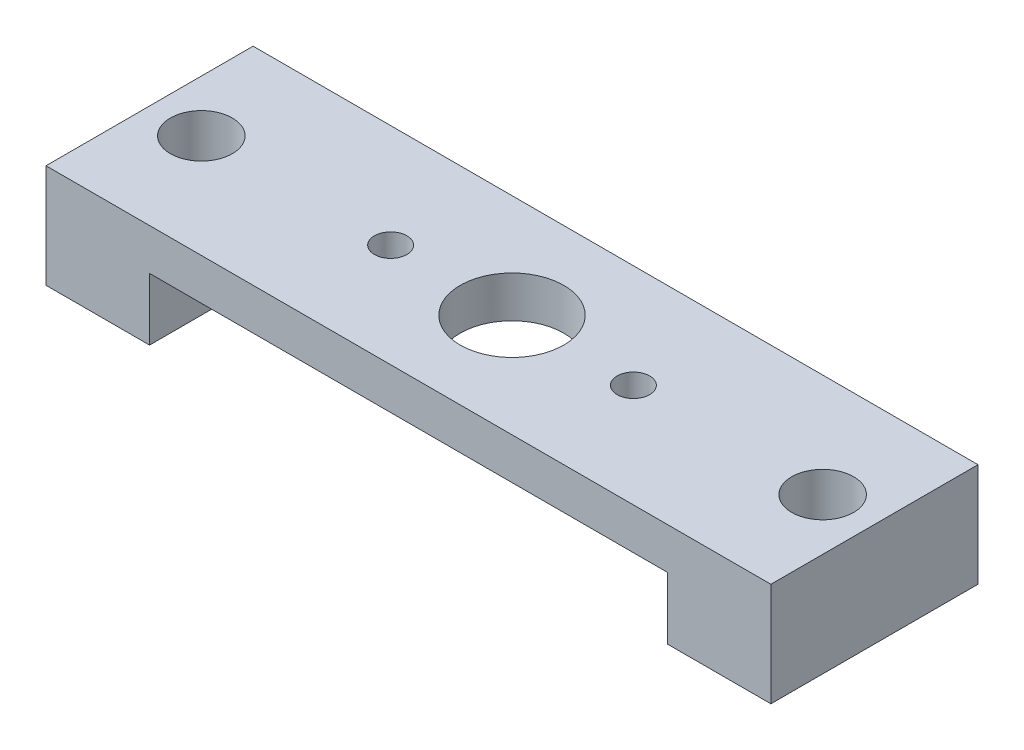
ISO-10303-21;
HEADER;
FILE_DESCRIPTION(('STEP AP214'),'2;1');
FILE_NAME('part.step','',(''),(''),'','','');
FILE_SCHEMA(('AUTOMOTIVE_DESIGN { 1 0 10303 214 1 1 1 1 }'));
ENDSEC;
DATA;
#1=APPLICATION_CONTEXT('core data for automotive mechanical design processes');
#2=APPLICATION_PROTOCOL_DEFINITION('international standard','automotive_design',2000,#1);
#3=PRODUCT_CONTEXT('',#1,'mechanical');
#4=PRODUCT('Part','Part','',(#3));
#5=PRODUCT_RELATED_PRODUCT_CATEGORY('part','',(#4));
#6=PRODUCT_DEFINITION_FORMATION('','',#4);
#7=PRODUCT_DEFINITION_CONTEXT('part definition',#1,'design');
#8=PRODUCT_DEFINITION('design','',#6,#7);
#9=PRODUCT_DEFINITION_SHAPE('','',#8);
#10=(LENGTH_UNIT() NAMED_UNIT(*) SI_UNIT(.MILLI.,.METRE.));
#11=(NAMED_UNIT(*) PLANE_ANGLE_UNIT() SI_UNIT($,.RADIAN.));
#12=(NAMED_UNIT(*) SI_UNIT($,.STERADIAN.) SOLID_ANGLE_UNIT());
#13=UNCERTAINTY_MEASURE_WITH_UNIT(LENGTH_MEASURE(1.E-05),#10,'distance_accuracy_value','');
#14=(GEOMETRIC_REPRESENTATION_CONTEXT(3) GLOBAL_UNCERTAINTY_ASSIGNED_CONTEXT((#13)) GLOBAL_UNIT_ASSIGNED_CONTEXT((#10,
#11,#12)) REPRESENTATION_CONTEXT('',''));
#15=CARTESIAN_POINT('',(0.,0.,0.));
#16=DIRECTION('',(0.,0.,1.));
#17=DIRECTION('',(1.,0.,0.));
#18=AXIS2_PLACEMENT_3D('',#15,#16,#17);
#19=CARTESIAN_POINT('',(0.,0.,0.));
#20=DIRECTION('',(0.,-1.,0.));
#21=DIRECTION('',(0.,0.,-1.));
#22=AXIS2_PLACEMENT_3D('',#19,#20,#21);
#23=PLANE('',#22);
#24=CARTESIAN_POINT('',(22.225,0.,-6.35));
#25=DIRECTION('',(0.,-1.,0.));
#26=DIRECTION('',(0.,0.,-1.));
#27=AXIS2_PLACEMENT_3D('',#24,#25,#26);
#28=CIRCLE('',#27,3.175);
#29=CARTESIAN_POINT('',(22.225,0.,-9.525));
#30=VERTEX_POINT('',#29);
#31=EDGE_CURVE('E341',#30,#30,#28,.T.);
#32=ORIENTED_EDGE('',*,*,#31,.F.);
#33=EDGE_LOOP('',(#32));
#34=FACE_BOUND('',#33,.T.);
#35=CARTESIAN_POINT('',(14.7828,0.,-6.35));
#36=DIRECTION('',(0.,-1.,0.));
#37=DIRECTION('',(0.,0.,-1.));
#38=AXIS2_PLACEMENT_3D('',#35,#36,#37);
#39=CIRCLE('',#38,0.99695);
#40=CARTESIAN_POINT('',(14.7828,0.,-7.34695));
#41=VERTEX_POINT('',#40);
#42=EDGE_CURVE('E351',#41,#41,#39,.T.);
#43=ORIENTED_EDGE('',*,*,#42,.F.);
#44=EDGE_LOOP('',(#43));
#45=FACE_BOUND('',#44,.T.);
#46=CARTESIAN_POINT('',(29.6672,0.,-6.35));
#47=DIRECTION('',(0.,-1.,0.));
#48=DIRECTION('',(0.,0.,-1.));
#49=AXIS2_PLACEMENT_3D('',#46,#47,#48);
#50=CIRCLE('',#49,0.99695);
#51=CARTESIAN_POINT('',(29.6672,0.,-7.34695));
#52=VERTEX_POINT('',#51);
#53=EDGE_CURVE('E357',#52,#52,#50,.T.);
#54=ORIENTED_EDGE('',*,*,#53,.F.);
#55=EDGE_LOOP('',(#54));
#56=FACE_BOUND('',#55,.T.);
#57=DIRECTION('',(-1.,0.,0.));
#58=VECTOR('',#57,1.);
#59=CARTESIAN_POINT('',(0.,0.,-12.7));
#60=LINE('',#59,#58);
#61=CARTESIAN_POINT('',(38.1,0.,-12.7));
#62=VERTEX_POINT('',#61);
#63=CARTESIAN_POINT('',(6.35,0.,-12.7));
#64=VERTEX_POINT('',#63);
#65=EDGE_CURVE('E55',#62,#64,#60,.T.);
#66=ORIENTED_EDGE('',*,*,#65,.F.);
#67=DIRECTION('',(0.,0.,-1.));
#68=VECTOR('',#67,1.);
#69=CARTESIAN_POINT('',(38.1,0.,0.));
#70=LINE('',#69,#68);
#71=CARTESIAN_POINT('',(38.1,0.,0.));
#72=VERTEX_POINT('',#71);
#73=EDGE_CURVE('E121',#72,#62,#70,.T.);
#74=ORIENTED_EDGE('',*,*,#73,.F.);
#75=DIRECTION('',(1.,0.,0.));
#76=VECTOR('',#75,1.);
#77=CARTESIAN_POINT('',(0.,0.,0.));
#78=LINE('',#77,#76);
#79=CARTESIAN_POINT('',(6.35,0.,0.));
#80=VERTEX_POINT('',#79);
#81=EDGE_CURVE('E151',#80,#72,#78,.T.);
#82=ORIENTED_EDGE('',*,*,#81,.F.);
#83=DIRECTION('',(0.,0.,1.));
#84=VECTOR('',#83,1.);
#85=CARTESIAN_POINT('',(6.35,0.,0.));
#86=LINE('',#85,#84);
#87=EDGE_CURVE('E132',#64,#80,#86,.T.);
#88=ORIENTED_EDGE('',*,*,#87,.F.);
#89=EDGE_LOOP('',(#66,#74,#82,#88));
#90=FACE_BOUND('',#89,.T.);
#91=ADVANCED_FACE('F35',(#34,#45,#56,#90),#23,.T.);
#92=CARTESIAN_POINT('',(0.,2.54,0.));
#93=DIRECTION('',(1.,0.,0.));
#94=DIRECTION('',(0.,0.,-1.));
#95=AXIS2_PLACEMENT_3D('',#92,#93,#94);
#96=PLANE('',#95);
#97=DIRECTION('',(0.,-1.,0.));
#98=VECTOR('',#97,1.);
#99=CARTESIAN_POINT('',(0.,2.54,-12.7));
#100=LINE('',#99,#98);
#101=CARTESIAN_POINT('',(0.,2.54,-12.7));
#102=VERTEX_POINT('',#101);
#103=CARTESIAN_POINT('',(0.,-3.81,-12.7));
#104=VERTEX_POINT('',#103);
#105=EDGE_CURVE('E160',#102,#104,#100,.T.);
#106=ORIENTED_EDGE('',*,*,#105,.T.);
#107=DIRECTION('',(0.,0.,-1.));
#108=VECTOR('',#107,1.);
#109=CARTESIAN_POINT('',(0.,-3.81,0.));
#110=LINE('',#109,#108);
#111=CARTESIAN_POINT('',(0.,-3.81,0.));
#112=VERTEX_POINT('',#111);
#113=EDGE_CURVE('E133',#112,#104,#110,.T.);
#114=ORIENTED_EDGE('',*,*,#113,.F.);
#115=DIRECTION('',(0.,-1.,0.));
#116=VECTOR('',#115,1.);
#117=CARTESIAN_POINT('',(0.,2.54,0.));
#118=LINE('',#117,#116);
#119=CARTESIAN_POINT('',(0.,2.54,0.));
#120=VERTEX_POINT('',#119);
#121=EDGE_CURVE('E11',#120,#112,#118,.T.);
#122=ORIENTED_EDGE('',*,*,#121,.F.);
#123=DIRECTION('',(0.,0.,1.));
#124=VECTOR('',#123,1.);
#125=CARTESIAN_POINT('',(0.,2.54,0.));
#126=LINE('',#125,#124);
#127=EDGE_CURVE('E152',#102,#120,#126,.T.);
#128=ORIENTED_EDGE('',*,*,#127,.F.);
#129=EDGE_LOOP('',(#106,#114,#122,#128));
#130=FACE_BOUND('',#129,.T.);
#131=ADVANCED_FACE('F37',(#130),#96,.F.);
#132=CARTESIAN_POINT('',(0.,2.54,0.));
#133=DIRECTION('',(0.,0.,-1.));
#134=DIRECTION('',(-1.,0.,0.));
#135=AXIS2_PLACEMENT_3D('',#132,#133,#134);
#136=PLANE('',#135);
#137=ORIENTED_EDGE('',*,*,#121,.T.);
#138=DIRECTION('',(-1.,0.,0.));
#139=VECTOR('',#138,1.);
#140=CARTESIAN_POINT('',(0.,-3.81,0.));
#141=LINE('',#140,#139);
#142=CARTESIAN_POINT('',(6.35,-3.81,0.));
#143=VERTEX_POINT('',#142);
#144=EDGE_CURVE('E140',#143,#112,#141,.T.);
#145=ORIENTED_EDGE('',*,*,#144,.F.);
#146=DIRECTION('',(0.,1.,0.));
#147=VECTOR('',#146,1.);
#148=CARTESIAN_POINT('',(6.35,-3.81,0.));
#149=LINE('',#148,#147);
#150=EDGE_CURVE('E143',#143,#80,#149,.T.);
#151=ORIENTED_EDGE('',*,*,#150,.T.);
#152=ORIENTED_EDGE('',*,*,#81,.T.);
#153=DIRECTION('',(0.,1.,0.));
#154=VECTOR('',#153,1.);
#155=CARTESIAN_POINT('',(38.1,-3.81,0.));
#156=LINE('',#155,#154);
#157=CARTESIAN_POINT('',(38.1,-3.81,0.));
#158=VERTEX_POINT('',#157);
#159=EDGE_CURVE('E113',#158,#72,#156,.T.);
#160=ORIENTED_EDGE('',*,*,#159,.F.);
#161=DIRECTION('',(-1.,0.,0.));
#162=VECTOR('',#161,1.);
#163=CARTESIAN_POINT('',(44.45,-3.81,0.));
#164=LINE('',#163,#162);
#165=CARTESIAN_POINT('',(44.45,-3.81,0.));
#166=VERTEX_POINT('',#165);
#167=EDGE_CURVE('E110',#166,#158,#164,.T.);
#168=ORIENTED_EDGE('',*,*,#167,.F.);
#169=DIRECTION('',(0.,-1.,0.));
#170=VECTOR('',#169,1.);
#171=CARTESIAN_POINT('',(44.45,2.54,0.));
#172=LINE('',#171,#170);
#173=CARTESIAN_POINT('',(44.45,2.54,0.));
#174=VERTEX_POINT('',#173);
#175=EDGE_CURVE('E43',#174,#166,#172,.T.);
#176=ORIENTED_EDGE('',*,*,#175,.F.);
#177=DIRECTION('',(1.,0.,0.));
#178=VECTOR('',#177,1.);
#179=CARTESIAN_POINT('',(0.,2.54,0.));
#180=LINE('',#179,#178);
#181=EDGE_CURVE('E155',#120,#174,#180,.T.);
#182=ORIENTED_EDGE('',*,*,#181,.F.);
#183=EDGE_LOOP('',(#137,#145,#151,#152,#160,#168,#176,#182));
#184=FACE_BOUND('',#183,.T.);
#185=ADVANCED_FACE('F111',(#184),#136,.F.);
#186=CARTESIAN_POINT('',(44.45,2.54,0.));
#187=DIRECTION('',(-1.,0.,0.));
#188=DIRECTION('',(0.,0.,1.));
#189=AXIS2_PLACEMENT_3D('',#186,#187,#188);
#190=PLANE('',#189);
#191=ORIENTED_EDGE('',*,*,#175,.T.);
#192=DIRECTION('',(0.,0.,1.));
#193=VECTOR('',#192,1.);
#194=CARTESIAN_POINT('',(44.45,-3.81,0.));
#195=LINE('',#194,#193);
#196=CARTESIAN_POINT('',(44.45,-3.81,-12.7));
#197=VERTEX_POINT('',#196);
#198=EDGE_CURVE('E105',#197,#166,#195,.T.);
#199=ORIENTED_EDGE('',*,*,#198,.F.);
#200=DIRECTION('',(0.,-1.,0.));
#201=VECTOR('',#200,1.);
#202=CARTESIAN_POINT('',(44.45,2.54,-12.7));
#203=LINE('',#202,#201);
#204=CARTESIAN_POINT('',(44.45,2.54,-12.7));
#205=VERTEX_POINT('',#204);
#206=EDGE_CURVE('E108',#205,#197,#203,.T.);
#207=ORIENTED_EDGE('',*,*,#206,.F.);
#208=DIRECTION('',(0.,0.,-1.));
#209=VECTOR('',#208,1.);
#210=CARTESIAN_POINT('',(44.45,2.54,0.));
#211=LINE('',#210,#209);
#212=EDGE_CURVE('E106',#174,#205,#211,.T.);
#213=ORIENTED_EDGE('',*,*,#212,.F.);
#214=EDGE_LOOP('',(#191,#199,#207,#213));
#215=FACE_BOUND('',#214,.T.);
#216=ADVANCED_FACE('F102',(#215),#190,.F.);
#217=CARTESIAN_POINT('',(0.,2.54,-12.7));
#218=DIRECTION('',(0.,0.,1.));
#219=DIRECTION('',(1.,0.,0.));
#220=AXIS2_PLACEMENT_3D('',#217,#218,#219);
#221=PLANE('',#220);
#222=ORIENTED_EDGE('',*,*,#206,.T.);
#223=DIRECTION('',(1.,0.,0.));
#224=VECTOR('',#223,1.);
#225=CARTESIAN_POINT('',(44.45,-3.81,-12.7));
#226=LINE('',#225,#224);
#227=CARTESIAN_POINT('',(38.1,-3.81,-12.7));
#228=VERTEX_POINT('',#227);
#229=EDGE_CURVE('E120',#228,#197,#226,.T.);
#230=ORIENTED_EDGE('',*,*,#229,.F.);
#231=DIRECTION('',(0.,1.,0.));
#232=VECTOR('',#231,1.);
#233=CARTESIAN_POINT('',(38.1,-3.81,-12.7));
#234=LINE('',#233,#232);
#235=EDGE_CURVE('E50',#228,#62,#234,.T.);
#236=ORIENTED_EDGE('',*,*,#235,.T.);
#237=ORIENTED_EDGE('',*,*,#65,.T.);
#238=DIRECTION('',(0.,1.,0.));
#239=VECTOR('',#238,1.);
#240=CARTESIAN_POINT('',(6.35,-3.81,-12.7));
#241=LINE('',#240,#239);
#242=CARTESIAN_POINT('',(6.35,-3.81,-12.7));
#243=VERTEX_POINT('',#242);
#244=EDGE_CURVE('E148',#243,#64,#241,.T.);
#245=ORIENTED_EDGE('',*,*,#244,.F.);
#246=DIRECTION('',(1.,0.,0.));
#247=VECTOR('',#246,1.);
#248=CARTESIAN_POINT('',(0.,-3.81,-12.7));
#249=LINE('',#248,#247);
#250=EDGE_CURVE('E136',#104,#243,#249,.T.);
#251=ORIENTED_EDGE('',*,*,#250,.F.);
#252=ORIENTED_EDGE('',*,*,#105,.F.);
#253=DIRECTION('',(-1.,0.,0.));
#254=VECTOR('',#253,1.);
#255=CARTESIAN_POINT('',(0.,2.54,-12.7));
#256=LINE('',#255,#254);
#257=EDGE_CURVE('E158',#205,#102,#256,.T.);
#258=ORIENTED_EDGE('',*,*,#257,.F.);
#259=EDGE_LOOP('',(#222,#230,#236,#237,#245,#251,#252,#258));
#260=FACE_BOUND('',#259,.T.);
#261=ADVANCED_FACE('F165',(#260),#221,.F.);
#262=CARTESIAN_POINT('',(0.,2.54,0.));
#263=DIRECTION('',(0.,-1.,0.));
#264=DIRECTION('',(0.,0.,-1.));
#265=AXIS2_PLACEMENT_3D('',#262,#263,#264);
#266=PLANE('',#265);
#267=CARTESIAN_POINT('',(22.225,2.54,-6.35));
#268=DIRECTION('',(0.,1.,0.));
#269=DIRECTION('',(0.,0.,1.));
#270=AXIS2_PLACEMENT_3D('',#267,#268,#269);
#271=CIRCLE('',#270,3.175);
#272=CARTESIAN_POINT('',(22.225,2.54,-3.175));
#273=VERTEX_POINT('',#272);
#274=EDGE_CURVE('E344',#273,#273,#271,.T.);
#275=ORIENTED_EDGE('',*,*,#274,.F.);
#276=EDGE_LOOP('',(#275));
#277=FACE_BOUND('',#276,.T.);
#278=CARTESIAN_POINT('',(14.7828,2.54,-6.35));
#279=DIRECTION('',(0.,1.,0.));
#280=DIRECTION('',(0.,0.,1.));
#281=AXIS2_PLACEMENT_3D('',#278,#279,#280);
#282=CIRCLE('',#281,0.99695);
#283=CARTESIAN_POINT('',(14.7828,2.54,-5.35305));
#284=VERTEX_POINT('',#283);
#285=EDGE_CURVE('E346',#284,#284,#282,.T.);
#286=ORIENTED_EDGE('',*,*,#285,.F.);
#287=EDGE_LOOP('',(#286));
#288=FACE_BOUND('',#287,.T.);
#289=CARTESIAN_POINT('',(29.6672,2.54,-6.35));
#290=DIRECTION('',(0.,1.,0.));
#291=DIRECTION('',(0.,0.,1.));
#292=AXIS2_PLACEMENT_3D('',#289,#290,#291);
#293=CIRCLE('',#292,0.99695);
#294=CARTESIAN_POINT('',(29.6672,2.54,-5.35305));
#295=VERTEX_POINT('',#294);
#296=EDGE_CURVE('E354',#295,#295,#293,.T.);
#297=ORIENTED_EDGE('',*,*,#296,.F.);
#298=EDGE_LOOP('',(#297));
#299=FACE_BOUND('',#298,.T.);
#300=CARTESIAN_POINT('',(3.175,2.54,-6.35));
#301=DIRECTION('',(0.,1.,0.));
#302=DIRECTION('',(0.,0.,1.));
#303=AXIS2_PLACEMENT_3D('',#300,#301,#302);
#304=CIRCLE('',#303,1.89865);
#305=CARTESIAN_POINT('',(3.175,2.54,-4.45135));
#306=VERTEX_POINT('',#305);
#307=EDGE_CURVE('E360',#306,#306,#304,.T.);
#308=ORIENTED_EDGE('',*,*,#307,.F.);
#309=EDGE_LOOP('',(#308));
#310=FACE_BOUND('',#309,.T.);
#311=CARTESIAN_POINT('',(41.275,2.54,-6.35));
#312=DIRECTION('',(0.,1.,0.));
#313=DIRECTION('',(0.,0.,1.));
#314=AXIS2_PLACEMENT_3D('',#311,#312,#313);
#315=CIRCLE('',#314,1.89865);
#316=CARTESIAN_POINT('',(41.275,2.54,-4.45135));
#317=VERTEX_POINT('',#316);
#318=EDGE_CURVE('E365',#317,#317,#315,.T.);
#319=ORIENTED_EDGE('',*,*,#318,.F.);
#320=EDGE_LOOP('',(#319));
#321=FACE_BOUND('',#320,.T.);
#322=ORIENTED_EDGE('',*,*,#127,.T.);
#323=ORIENTED_EDGE('',*,*,#181,.T.);
#324=ORIENTED_EDGE('',*,*,#212,.T.);
#325=ORIENTED_EDGE('',*,*,#257,.T.);
#326=EDGE_LOOP('',(#322,#323,#324,#325));
#327=FACE_BOUND('',#326,.T.);
#328=ADVANCED_FACE('F170',(#277,#288,#299,#310,#321,#327),#266,.F.);
#329=CARTESIAN_POINT('',(6.35,-3.81,0.));
#330=DIRECTION('',(-1.,0.,0.));
#331=DIRECTION('',(0.,0.,1.));
#332=AXIS2_PLACEMENT_3D('',#329,#330,#331);
#333=PLANE('',#332);
#334=ORIENTED_EDGE('',*,*,#87,.T.);
#335=ORIENTED_EDGE('',*,*,#150,.F.);
#336=DIRECTION('',(0.,0.,1.));
#337=VECTOR('',#336,1.);
#338=CARTESIAN_POINT('',(6.35,-3.81,0.));
#339=LINE('',#338,#337);
#340=EDGE_CURVE('E138',#243,#143,#339,.T.);
#341=ORIENTED_EDGE('',*,*,#340,.F.);
#342=ORIENTED_EDGE('',*,*,#244,.T.);
#343=EDGE_LOOP('',(#334,#335,#341,#342));
#344=FACE_BOUND('',#343,.T.);
#345=ADVANCED_FACE('F180',(#344),#333,.F.);
#346=CARTESIAN_POINT('',(0.,-3.81,0.));
#347=DIRECTION('',(0.,-1.,0.));
#348=DIRECTION('',(0.,0.,-1.));
#349=AXIS2_PLACEMENT_3D('',#346,#347,#348);
#350=PLANE('',#349);
#351=CARTESIAN_POINT('',(3.175,-3.81,-6.35));
#352=DIRECTION('',(0.,1.,0.));
#353=DIRECTION('',(0.,0.,1.));
#354=AXIS2_PLACEMENT_3D('',#351,#352,#353);
#355=CIRCLE('',#354,1.89865);
#356=CARTESIAN_POINT('',(3.175,-3.81,-4.45135));
#357=VERTEX_POINT('',#356);
#358=EDGE_CURVE('E363',#357,#357,#355,.T.);
#359=ORIENTED_EDGE('',*,*,#358,.T.);
#360=EDGE_LOOP('',(#359));
#361=FACE_BOUND('',#360,.T.);
#362=ORIENTED_EDGE('',*,*,#113,.T.);
#363=ORIENTED_EDGE('',*,*,#250,.T.);
#364=ORIENTED_EDGE('',*,*,#340,.T.);
#365=ORIENTED_EDGE('',*,*,#144,.T.);
#366=EDGE_LOOP('',(#362,#363,#364,#365));
#367=FACE_BOUND('',#366,.T.);
#368=ADVANCED_FACE('F176',(#361,#367),#350,.T.);
#369=CARTESIAN_POINT('',(38.1,-3.81,0.));
#370=DIRECTION('',(1.,0.,0.));
#371=DIRECTION('',(0.,0.,-1.));
#372=AXIS2_PLACEMENT_3D('',#369,#370,#371);
#373=PLANE('',#372);
#374=ORIENTED_EDGE('',*,*,#73,.T.);
#375=ORIENTED_EDGE('',*,*,#235,.F.);
#376=DIRECTION('',(0.,0.,-1.));
#377=VECTOR('',#376,1.);
#378=CARTESIAN_POINT('',(38.1,-3.81,0.));
#379=LINE('',#378,#377);
#380=EDGE_CURVE('E116',#158,#228,#379,.T.);
#381=ORIENTED_EDGE('',*,*,#380,.F.);
#382=ORIENTED_EDGE('',*,*,#159,.T.);
#383=EDGE_LOOP('',(#374,#375,#381,#382));
#384=FACE_BOUND('',#383,.T.);
#385=ADVANCED_FACE('F184',(#384),#373,.F.);
#386=CARTESIAN_POINT('',(0.,-3.81,0.));
#387=DIRECTION('',(0.,1.,0.));
#388=DIRECTION('',(0.,0.,1.));
#389=AXIS2_PLACEMENT_3D('',#386,#387,#388);
#390=PLANE('',#389);
#391=CARTESIAN_POINT('',(41.275,-3.81,-6.35));
#392=DIRECTION('',(0.,1.,0.));
#393=DIRECTION('',(0.,0.,1.));
#394=AXIS2_PLACEMENT_3D('',#391,#392,#393);
#395=CIRCLE('',#394,1.89864999999999);
#396=CARTESIAN_POINT('',(41.275,-3.81,-4.45135000000001));
#397=VERTEX_POINT('',#396);
#398=EDGE_CURVE('E123',#397,#397,#395,.T.);
#399=ORIENTED_EDGE('',*,*,#398,.T.);
#400=EDGE_LOOP('',(#399));
#401=FACE_BOUND('',#400,.T.);
#402=ORIENTED_EDGE('',*,*,#198,.T.);
#403=ORIENTED_EDGE('',*,*,#167,.T.);
#404=ORIENTED_EDGE('',*,*,#380,.T.);
#405=ORIENTED_EDGE('',*,*,#229,.T.);
#406=EDGE_LOOP('',(#402,#403,#404,#405));
#407=FACE_BOUND('',#406,.T.);
#408=ADVANCED_FACE('F119',(#401,#407),#390,.F.);
#409=CARTESIAN_POINT('',(41.275,2.54,-6.35));
#410=DIRECTION('',(0.,1.,0.));
#411=DIRECTION('',(0.,0.,1.));
#412=AXIS2_PLACEMENT_3D('',#409,#410,#411);
#413=CYLINDRICAL_SURFACE('',#412,1.89865);
#414=ORIENTED_EDGE('',*,*,#398,.F.);
#415=EDGE_LOOP('',(#414));
#416=FACE_BOUND('',#415,.T.);
#417=ORIENTED_EDGE('',*,*,#318,.T.);
#418=EDGE_LOOP('',(#417));
#419=FACE_BOUND('',#418,.T.);
#420=ADVANCED_FACE('F191',(#416,#419),#413,.F.);
#421=CARTESIAN_POINT('',(3.175,2.54,-6.35));
#422=DIRECTION('',(0.,1.,0.));
#423=DIRECTION('',(0.,0.,1.));
#424=AXIS2_PLACEMENT_3D('',#421,#422,#423);
#425=CYLINDRICAL_SURFACE('',#424,1.89865);
#426=ORIENTED_EDGE('',*,*,#358,.F.);
#427=EDGE_LOOP('',(#426));
#428=FACE_BOUND('',#427,.T.);
#429=ORIENTED_EDGE('',*,*,#307,.T.);
#430=EDGE_LOOP('',(#429));
#431=FACE_BOUND('',#430,.T.);
#432=ADVANCED_FACE('F256',(#428,#431),#425,.F.);
#433=CARTESIAN_POINT('',(29.6672,2.54,-6.35));
#434=DIRECTION('',(0.,1.,0.));
#435=DIRECTION('',(0.,0.,1.));
#436=AXIS2_PLACEMENT_3D('',#433,#434,#435);
#437=CYLINDRICAL_SURFACE('',#436,0.99695);
#438=ORIENTED_EDGE('',*,*,#53,.T.);
#439=EDGE_LOOP('',(#438));
#440=FACE_BOUND('',#439,.T.);
#441=ORIENTED_EDGE('',*,*,#296,.T.);
#442=EDGE_LOOP('',(#441));
#443=FACE_BOUND('',#442,.T.);
#444=ADVANCED_FACE('F266',(#440,#443),#437,.F.);
#445=CARTESIAN_POINT('',(14.7828,2.54,-6.35));
#446=DIRECTION('',(0.,1.,0.));
#447=DIRECTION('',(0.,0.,1.));
#448=AXIS2_PLACEMENT_3D('',#445,#446,#447);
#449=CYLINDRICAL_SURFACE('',#448,0.99695);
#450=ORIENTED_EDGE('',*,*,#42,.T.);
#451=EDGE_LOOP('',(#450));
#452=FACE_BOUND('',#451,.T.);
#453=ORIENTED_EDGE('',*,*,#285,.T.);
#454=EDGE_LOOP('',(#453));
#455=FACE_BOUND('',#454,.T.);
#456=ADVANCED_FACE('F277',(#452,#455),#449,.F.);
#457=CARTESIAN_POINT('',(22.225,2.54,-6.35));
#458=DIRECTION('',(0.,1.,0.));
#459=DIRECTION('',(0.,0.,1.));
#460=AXIS2_PLACEMENT_3D('',#457,#458,#459);
#461=CYLINDRICAL_SURFACE('',#460,3.175);
#462=ORIENTED_EDGE('',*,*,#31,.T.);
#463=EDGE_LOOP('',(#462));
#464=FACE_BOUND('',#463,.T.);
#465=ORIENTED_EDGE('',*,*,#274,.T.);
#466=EDGE_LOOP('',(#465));
#467=FACE_BOUND('',#466,.T.);
#468=ADVANCED_FACE('F287',(#464,#467),#461,.F.);
#469=CLOSED_SHELL('',(#91,#131,#185,#216,#261,#328,#345,#368,#385,#408,#420,#432,#444,#456,#468));
#470=MANIFOLD_SOLID_BREP('B2',#469);
#471=ADVANCED_BREP_SHAPE_REPRESENTATION('',(#18,#470),#14);
#472=SHAPE_DEFINITION_REPRESENTATION(#9,#471);
ENDSEC;
END-ISO-10303-21;
